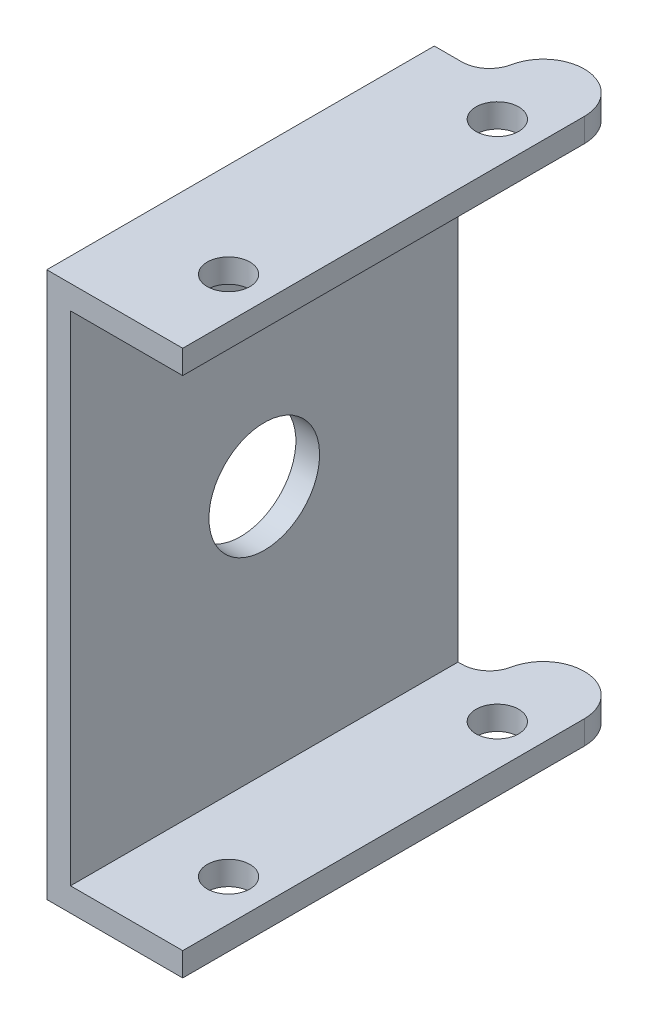
ISO-10303-21;
HEADER;
FILE_DESCRIPTION(('STEP AP214'),'2;1');
FILE_NAME('part.step','',(''),(''),'','','');
FILE_SCHEMA(('AUTOMOTIVE_DESIGN { 1 0 10303 214 1 1 1 1 }'));
ENDSEC;
DATA;
#1=APPLICATION_CONTEXT('core data for automotive mechanical design processes');
#2=APPLICATION_PROTOCOL_DEFINITION('international standard','automotive_design',2000,#1);
#3=PRODUCT_CONTEXT('',#1,'mechanical');
#4=PRODUCT('Part','Part','',(#3));
#5=PRODUCT_RELATED_PRODUCT_CATEGORY('part','',(#4));
#6=PRODUCT_DEFINITION_FORMATION('','',#4);
#7=PRODUCT_DEFINITION_CONTEXT('part definition',#1,'design');
#8=PRODUCT_DEFINITION('design','',#6,#7);
#9=PRODUCT_DEFINITION_SHAPE('','',#8);
#10=(LENGTH_UNIT() NAMED_UNIT(*) SI_UNIT(.MILLI.,.METRE.));
#11=(NAMED_UNIT(*) PLANE_ANGLE_UNIT() SI_UNIT($,.RADIAN.));
#12=(NAMED_UNIT(*) SI_UNIT($,.STERADIAN.) SOLID_ANGLE_UNIT());
#13=UNCERTAINTY_MEASURE_WITH_UNIT(LENGTH_MEASURE(1.E-05),#10,'distance_accuracy_value','');
#14=(GEOMETRIC_REPRESENTATION_CONTEXT(3) GLOBAL_UNCERTAINTY_ASSIGNED_CONTEXT((#13)) GLOBAL_UNIT_ASSIGNED_CONTEXT((#10,
#11,#12)) REPRESENTATION_CONTEXT('',''));
#15=CARTESIAN_POINT('',(0.,0.,0.));
#16=DIRECTION('',(0.,0.,1.));
#17=DIRECTION('',(1.,0.,0.));
#18=AXIS2_PLACEMENT_3D('',#15,#16,#17);
#19=CARTESIAN_POINT('',(8.6,0.,14.));
#20=DIRECTION('',(0.,1.,0.));
#21=DIRECTION('',(-1.,0.,0.));
#22=AXIS2_PLACEMENT_3D('',#19,#20,#21);
#23=PLANE('',#22);
#24=CARTESIAN_POINT('',(6.,0.,8.5));
#25=DIRECTION('',(0.,1.,0.));
#26=DIRECTION('',(-1.,0.,0.));
#27=AXIS2_PLACEMENT_3D('',#24,#25,#26);
#28=CIRCLE('',#27,1.35);
#29=CARTESIAN_POINT('',(4.65,0.,8.5));
#30=VERTEX_POINT('',#29);
#31=EDGE_CURVE('E162',#30,#30,#28,.T.);
#32=ORIENTED_EDGE('',*,*,#31,.T.);
#33=EDGE_LOOP('',(#32));
#34=FACE_BOUND('',#33,.T.);
#35=CARTESIAN_POINT('',(6.,0.,-8.5));
#36=DIRECTION('',(0.,1.,0.));
#37=DIRECTION('',(-1.,0.,0.));
#38=AXIS2_PLACEMENT_3D('',#35,#36,#37);
#39=CIRCLE('',#38,1.35);
#40=CARTESIAN_POINT('',(4.65,0.,-8.5));
#41=VERTEX_POINT('',#40);
#42=EDGE_CURVE('E174',#41,#41,#39,.T.);
#43=ORIENTED_EDGE('',*,*,#42,.T.);
#44=EDGE_LOOP('',(#43));
#45=FACE_BOUND('',#44,.T.);
#46=CARTESIAN_POINT('',(6.,0.,-11.4));
#47=DIRECTION('',(0.,1.,0.));
#48=DIRECTION('',(0.,0.,1.));
#49=AXIS2_PLACEMENT_3D('',#46,#47,#48);
#50=CIRCLE('',#49,2.6);
#51=CARTESIAN_POINT('',(8.6,0.,-11.4));
#52=VERTEX_POINT('',#51);
#53=CARTESIAN_POINT('',(3.4511622832782,0.,-11.9132507124364));
#54=VERTEX_POINT('',#53);
#55=EDGE_CURVE('E121',#52,#54,#50,.T.);
#56=ORIENTED_EDGE('',*,*,#55,.F.);
#57=DIRECTION('',(0.,0.,-1.));
#58=VECTOR('',#57,1.);
#59=CARTESIAN_POINT('',(8.6,0.,14.));
#60=LINE('',#59,#58);
#61=CARTESIAN_POINT('',(8.6,0.,14.));
#62=VERTEX_POINT('',#61);
#63=EDGE_CURVE('E10',#62,#52,#60,.T.);
#64=ORIENTED_EDGE('',*,*,#63,.F.);
#65=DIRECTION('',(1.,0.,0.));
#66=VECTOR('',#65,1.);
#67=CARTESIAN_POINT('',(8.6,0.,14.));
#68=LINE('',#67,#66);
#69=CARTESIAN_POINT('',(0.,0.,14.));
#70=VERTEX_POINT('',#69);
#71=EDGE_CURVE('E185',#70,#62,#68,.T.);
#72=ORIENTED_EDGE('',*,*,#71,.F.);
#73=DIRECTION('',(0.,0.,-1.));
#74=VECTOR('',#73,1.);
#75=CARTESIAN_POINT('',(0.,0.,14.));
#76=LINE('',#75,#74);
#77=CARTESIAN_POINT('',(0.,0.,-10.514544668059));
#78=VERTEX_POINT('',#77);
#79=EDGE_CURVE('E125',#70,#78,#76,.T.);
#80=ORIENTED_EDGE('',*,*,#79,.T.);
#81=DIRECTION('',(-1.,0.,0.));
#82=VECTOR('',#81,1.);
#83=CARTESIAN_POINT('',(0.,0.,-10.514544668059));
#84=LINE('',#83,#82);
#85=CARTESIAN_POINT('',(1.74272766597048,0.,-10.514544668059));
#86=VERTEX_POINT('',#85);
#87=EDGE_CURVE('E30',#86,#78,#84,.T.);
#88=ORIENTED_EDGE('',*,*,#87,.F.);
#89=CARTESIAN_POINT('',(1.74272766597048,0.,-12.2572723340295));
#90=DIRECTION('',(0.,1.,0.));
#91=DIRECTION('',(0.,0.,1.));
#92=AXIS2_PLACEMENT_3D('',#89,#90,#91);
#93=CIRCLE('',#92,1.74272766597049);
#94=EDGE_CURVE('E115',#86,#54,#93,.T.);
#95=ORIENTED_EDGE('',*,*,#94,.T.);
#96=EDGE_LOOP('',(#56,#64,#72,#80,#88,#95));
#97=FACE_BOUND('',#96,.T.);
#98=ADVANCED_FACE('F16',(#34,#45,#97),#23,.F.);
#99=CARTESIAN_POINT('',(1.5,1.5,14.));
#100=DIRECTION('',(0.,-1.,0.));
#101=DIRECTION('',(0.,0.,-1.));
#102=AXIS2_PLACEMENT_3D('',#99,#100,#101);
#103=PLANE('',#102);
#104=CARTESIAN_POINT('',(6.,1.5,8.5));
#105=DIRECTION('',(0.,-1.,0.));
#106=DIRECTION('',(0.,0.,-1.));
#107=AXIS2_PLACEMENT_3D('',#104,#105,#106);
#108=CIRCLE('',#107,1.35);
#109=CARTESIAN_POINT('',(6.,1.5,7.15));
#110=VERTEX_POINT('',#109);
#111=EDGE_CURVE('E170',#110,#110,#108,.T.);
#112=ORIENTED_EDGE('',*,*,#111,.T.);
#113=EDGE_LOOP('',(#112));
#114=FACE_BOUND('',#113,.T.);
#115=CARTESIAN_POINT('',(6.,1.5,-8.5));
#116=DIRECTION('',(0.,-1.,0.));
#117=DIRECTION('',(0.,0.,-1.));
#118=AXIS2_PLACEMENT_3D('',#115,#116,#117);
#119=CIRCLE('',#118,1.35);
#120=CARTESIAN_POINT('',(6.,1.5,-9.85));
#121=VERTEX_POINT('',#120);
#122=EDGE_CURVE('E182',#121,#121,#119,.T.);
#123=ORIENTED_EDGE('',*,*,#122,.T.);
#124=EDGE_LOOP('',(#123));
#125=FACE_BOUND('',#124,.T.);
#126=DIRECTION('',(0.,0.,-1.));
#127=VECTOR('',#126,1.);
#128=CARTESIAN_POINT('',(8.6,1.5,14.));
#129=LINE('',#128,#127);
#130=CARTESIAN_POINT('',(8.6,1.5,14.));
#131=VERTEX_POINT('',#130);
#132=CARTESIAN_POINT('',(8.6,1.5,-11.4));
#133=VERTEX_POINT('',#132);
#134=EDGE_CURVE('E23',#131,#133,#129,.T.);
#135=ORIENTED_EDGE('',*,*,#134,.T.);
#136=CARTESIAN_POINT('',(6.,1.5,-11.4));
#137=DIRECTION('',(0.,-1.,0.));
#138=DIRECTION('',(0.,0.,-1.));
#139=AXIS2_PLACEMENT_3D('',#136,#137,#138);
#140=CIRCLE('',#139,2.6);
#141=CARTESIAN_POINT('',(3.4511622832782,1.5,-11.9132507124364));
#142=VERTEX_POINT('',#141);
#143=EDGE_CURVE('E144',#142,#133,#140,.T.);
#144=ORIENTED_EDGE('',*,*,#143,.F.);
#145=CARTESIAN_POINT('',(1.74272766597048,1.5,-12.2572723340295));
#146=DIRECTION('',(0.,-1.,0.));
#147=DIRECTION('',(0.,0.,-1.));
#148=AXIS2_PLACEMENT_3D('',#145,#146,#147);
#149=CIRCLE('',#148,1.74272766597049);
#150=CARTESIAN_POINT('',(1.74272766597048,1.5,-10.514544668059));
#151=VERTEX_POINT('',#150);
#152=EDGE_CURVE('E159',#142,#151,#149,.T.);
#153=ORIENTED_EDGE('',*,*,#152,.T.);
#154=DIRECTION('',(1.,0.,0.));
#155=VECTOR('',#154,1.);
#156=CARTESIAN_POINT('',(1.5,1.5,-10.514544668059));
#157=LINE('',#156,#155);
#158=CARTESIAN_POINT('',(1.5,1.5,-10.514544668059));
#159=VERTEX_POINT('',#158);
#160=EDGE_CURVE('E107',#159,#151,#157,.T.);
#161=ORIENTED_EDGE('',*,*,#160,.F.);
#162=DIRECTION('',(0.,0.,-1.));
#163=VECTOR('',#162,1.);
#164=CARTESIAN_POINT('',(1.5,1.5,14.));
#165=LINE('',#164,#163);
#166=CARTESIAN_POINT('',(1.5,1.5,14.));
#167=VERTEX_POINT('',#166);
#168=EDGE_CURVE('E213',#167,#159,#165,.T.);
#169=ORIENTED_EDGE('',*,*,#168,.F.);
#170=DIRECTION('',(-1.,0.,0.));
#171=VECTOR('',#170,1.);
#172=CARTESIAN_POINT('',(1.5,1.5,14.));
#173=LINE('',#172,#171);
#174=EDGE_CURVE('E189',#131,#167,#173,.T.);
#175=ORIENTED_EDGE('',*,*,#174,.F.);
#176=EDGE_LOOP('',(#135,#144,#153,#161,#169,#175));
#177=FACE_BOUND('',#176,.T.);
#178=ADVANCED_FACE('F220',(#114,#125,#177),#103,.F.);
#179=CARTESIAN_POINT('',(1.5,33.,14.));
#180=DIRECTION('',(-1.,0.,0.));
#181=DIRECTION('',(0.,-1.,0.));
#182=AXIS2_PLACEMENT_3D('',#179,#180,#181);
#183=PLANE('',#182);
#184=CARTESIAN_POINT('',(1.5,17.25,1.74272766597048));
#185=DIRECTION('',(-1.,0.,0.));
#186=DIRECTION('',(0.,-1.,0.));
#187=AXIS2_PLACEMENT_3D('',#184,#185,#186);
#188=CIRCLE('',#187,3.5);
#189=CARTESIAN_POINT('',(1.5,13.75,1.74272766597048));
#190=VERTEX_POINT('',#189);
#191=EDGE_CURVE('E131',#190,#190,#188,.T.);
#192=ORIENTED_EDGE('',*,*,#191,.T.);
#193=EDGE_LOOP('',(#192));
#194=FACE_BOUND('',#193,.T.);
#195=DIRECTION('',(0.,-1.,0.));
#196=VECTOR('',#195,1.);
#197=CARTESIAN_POINT('',(1.5,33.,-10.514544668059));
#198=LINE('',#197,#196);
#199=CARTESIAN_POINT('',(1.5,33.,-10.514544668059));
#200=VERTEX_POINT('',#199);
#201=EDGE_CURVE('E153',#200,#159,#198,.T.);
#202=ORIENTED_EDGE('',*,*,#201,.F.);
#203=DIRECTION('',(0.,0.,-1.));
#204=VECTOR('',#203,1.);
#205=CARTESIAN_POINT('',(1.5,33.,14.));
#206=LINE('',#205,#204);
#207=CARTESIAN_POINT('',(1.5,33.,14.));
#208=VERTEX_POINT('',#207);
#209=EDGE_CURVE('E210',#208,#200,#206,.T.);
#210=ORIENTED_EDGE('',*,*,#209,.F.);
#211=DIRECTION('',(0.,1.,0.));
#212=VECTOR('',#211,1.);
#213=CARTESIAN_POINT('',(1.5,33.,14.));
#214=LINE('',#213,#212);
#215=EDGE_CURVE('E191',#167,#208,#214,.T.);
#216=ORIENTED_EDGE('',*,*,#215,.F.);
#217=ORIENTED_EDGE('',*,*,#168,.T.);
#218=EDGE_LOOP('',(#202,#210,#216,#217));
#219=FACE_BOUND('',#218,.T.);
#220=ADVANCED_FACE('F232',(#194,#219),#183,.F.);
#221=CARTESIAN_POINT('',(8.6,33.,14.));
#222=DIRECTION('',(0.,1.,0.));
#223=DIRECTION('',(0.,0.,1.));
#224=AXIS2_PLACEMENT_3D('',#221,#222,#223);
#225=PLANE('',#224);
#226=CARTESIAN_POINT('',(6.,33.,8.5));
#227=DIRECTION('',(0.,1.,0.));
#228=DIRECTION('',(0.,0.,1.));
#229=AXIS2_PLACEMENT_3D('',#226,#227,#228);
#230=CIRCLE('',#229,1.35);
#231=CARTESIAN_POINT('',(6.,33.,9.85));
#232=VERTEX_POINT('',#231);
#233=EDGE_CURVE('E165',#232,#232,#230,.T.);
#234=ORIENTED_EDGE('',*,*,#233,.T.);
#235=EDGE_LOOP('',(#234));
#236=FACE_BOUND('',#235,.T.);
#237=CARTESIAN_POINT('',(6.,33.,-8.5));
#238=DIRECTION('',(0.,1.,0.));
#239=DIRECTION('',(0.,0.,1.));
#240=AXIS2_PLACEMENT_3D('',#237,#238,#239);
#241=CIRCLE('',#240,1.35);
#242=CARTESIAN_POINT('',(6.,33.,-7.15));
#243=VERTEX_POINT('',#242);
#244=EDGE_CURVE('E177',#243,#243,#241,.T.);
#245=ORIENTED_EDGE('',*,*,#244,.T.);
#246=EDGE_LOOP('',(#245));
#247=FACE_BOUND('',#246,.T.);
#248=CARTESIAN_POINT('',(6.,33.,-11.4));
#249=DIRECTION('',(0.,1.,0.));
#250=DIRECTION('',(0.,0.,1.));
#251=AXIS2_PLACEMENT_3D('',#248,#249,#250);
#252=CIRCLE('',#251,2.6);
#253=CARTESIAN_POINT('',(8.6,33.,-11.4));
#254=VERTEX_POINT('',#253);
#255=CARTESIAN_POINT('',(3.4511622832782,33.,-11.9132507124364));
#256=VERTEX_POINT('',#255);
#257=EDGE_CURVE('E148',#254,#256,#252,.T.);
#258=ORIENTED_EDGE('',*,*,#257,.F.);
#259=DIRECTION('',(0.,0.,-1.));
#260=VECTOR('',#259,1.);
#261=CARTESIAN_POINT('',(8.6,33.,14.));
#262=LINE('',#261,#260);
#263=CARTESIAN_POINT('',(8.6,33.,14.));
#264=VERTEX_POINT('',#263);
#265=EDGE_CURVE('E207',#264,#254,#262,.T.);
#266=ORIENTED_EDGE('',*,*,#265,.F.);
#267=DIRECTION('',(1.,0.,0.));
#268=VECTOR('',#267,1.);
#269=CARTESIAN_POINT('',(8.6,33.,14.));
#270=LINE('',#269,#268);
#271=EDGE_CURVE('E193',#208,#264,#270,.T.);
#272=ORIENTED_EDGE('',*,*,#271,.F.);
#273=ORIENTED_EDGE('',*,*,#209,.T.);
#274=DIRECTION('',(-1.,0.,0.));
#275=VECTOR('',#274,1.);
#276=CARTESIAN_POINT('',(8.6,33.,-10.514544668059));
#277=LINE('',#276,#275);
#278=CARTESIAN_POINT('',(1.74272766597048,33.,-10.514544668059));
#279=VERTEX_POINT('',#278);
#280=EDGE_CURVE('E150',#279,#200,#277,.T.);
#281=ORIENTED_EDGE('',*,*,#280,.F.);
#282=CARTESIAN_POINT('',(1.74272766597048,33.,-12.2572723340295));
#283=DIRECTION('',(0.,1.,0.));
#284=DIRECTION('',(0.,0.,1.));
#285=AXIS2_PLACEMENT_3D('',#282,#283,#284);
#286=CIRCLE('',#285,1.74272766597049);
#287=EDGE_CURVE('E156',#279,#256,#286,.T.);
#288=ORIENTED_EDGE('',*,*,#287,.T.);
#289=EDGE_LOOP('',(#258,#266,#272,#273,#281,#288));
#290=FACE_BOUND('',#289,.T.);
#291=ADVANCED_FACE('F238',(#236,#247,#290),#225,.F.);
#292=CARTESIAN_POINT('',(0.,34.5,14.));
#293=DIRECTION('',(0.,-1.,0.));
#294=DIRECTION('',(0.,0.,-1.));
#295=AXIS2_PLACEMENT_3D('',#292,#293,#294);
#296=PLANE('',#295);
#297=CARTESIAN_POINT('',(6.,34.5,8.5));
#298=DIRECTION('',(0.,1.,0.));
#299=DIRECTION('',(-1.,0.,0.));
#300=AXIS2_PLACEMENT_3D('',#297,#298,#299);
#301=CIRCLE('',#300,1.35);
#302=CARTESIAN_POINT('',(4.65,34.5,8.5));
#303=VERTEX_POINT('',#302);
#304=EDGE_CURVE('E161',#303,#303,#301,.T.);
#305=ORIENTED_EDGE('',*,*,#304,.F.);
#306=EDGE_LOOP('',(#305));
#307=FACE_BOUND('',#306,.T.);
#308=CARTESIAN_POINT('',(6.,34.5,-8.5));
#309=DIRECTION('',(0.,1.,0.));
#310=DIRECTION('',(-1.,0.,0.));
#311=AXIS2_PLACEMENT_3D('',#308,#309,#310);
#312=CIRCLE('',#311,1.35);
#313=CARTESIAN_POINT('',(4.65,34.5,-8.5));
#314=VERTEX_POINT('',#313);
#315=EDGE_CURVE('E173',#314,#314,#312,.T.);
#316=ORIENTED_EDGE('',*,*,#315,.F.);
#317=EDGE_LOOP('',(#316));
#318=FACE_BOUND('',#317,.T.);
#319=CARTESIAN_POINT('',(6.,34.5,-11.4));
#320=DIRECTION('',(0.,1.,0.));
#321=DIRECTION('',(0.,0.,1.));
#322=AXIS2_PLACEMENT_3D('',#319,#320,#321);
#323=CIRCLE('',#322,2.6);
#324=CARTESIAN_POINT('',(8.6,34.5,-11.4));
#325=VERTEX_POINT('',#324);
#326=CARTESIAN_POINT('',(3.4511622832782,34.5,-11.9132507124364));
#327=VERTEX_POINT('',#326);
#328=EDGE_CURVE('E126',#325,#327,#323,.T.);
#329=ORIENTED_EDGE('',*,*,#328,.T.);
#330=CARTESIAN_POINT('',(1.74272766597048,34.5,-12.2572723340295));
#331=DIRECTION('',(0.,1.,0.));
#332=DIRECTION('',(0.,0.,1.));
#333=AXIS2_PLACEMENT_3D('',#330,#331,#332);
#334=CIRCLE('',#333,1.74272766597049);
#335=CARTESIAN_POINT('',(1.74272766597048,34.5,-10.514544668059));
#336=VERTEX_POINT('',#335);
#337=EDGE_CURVE('E128',#336,#327,#334,.T.);
#338=ORIENTED_EDGE('',*,*,#337,.F.);
#339=DIRECTION('',(-1.,0.,0.));
#340=VECTOR('',#339,1.);
#341=CARTESIAN_POINT('',(0.,34.5,-10.514544668059));
#342=LINE('',#341,#340);
#343=CARTESIAN_POINT('',(0.,34.5,-10.514544668059));
#344=VERTEX_POINT('',#343);
#345=EDGE_CURVE('E136',#336,#344,#342,.T.);
#346=ORIENTED_EDGE('',*,*,#345,.T.);
#347=DIRECTION('',(0.,0.,-1.));
#348=VECTOR('',#347,1.);
#349=CARTESIAN_POINT('',(0.,34.5,14.));
#350=LINE('',#349,#348);
#351=CARTESIAN_POINT('',(0.,34.5,14.));
#352=VERTEX_POINT('',#351);
#353=EDGE_CURVE('E201',#352,#344,#350,.T.);
#354=ORIENTED_EDGE('',*,*,#353,.F.);
#355=DIRECTION('',(-1.,0.,0.));
#356=VECTOR('',#355,1.);
#357=CARTESIAN_POINT('',(0.,34.5,14.));
#358=LINE('',#357,#356);
#359=CARTESIAN_POINT('',(8.6,34.5,14.));
#360=VERTEX_POINT('',#359);
#361=EDGE_CURVE('E197',#360,#352,#358,.T.);
#362=ORIENTED_EDGE('',*,*,#361,.F.);
#363=DIRECTION('',(0.,0.,-1.));
#364=VECTOR('',#363,1.);
#365=CARTESIAN_POINT('',(8.6,34.5,14.));
#366=LINE('',#365,#364);
#367=EDGE_CURVE('E204',#360,#325,#366,.T.);
#368=ORIENTED_EDGE('',*,*,#367,.T.);
#369=EDGE_LOOP('',(#329,#338,#346,#354,#362,#368));
#370=FACE_BOUND('',#369,.T.);
#371=ADVANCED_FACE('F247',(#307,#318,#370),#296,.F.);
#372=CARTESIAN_POINT('',(0.,0.,14.));
#373=DIRECTION('',(1.,0.,0.));
#374=DIRECTION('',(0.,0.,-1.));
#375=AXIS2_PLACEMENT_3D('',#372,#373,#374);
#376=PLANE('',#375);
#377=CARTESIAN_POINT('',(0.,17.25,1.74272766597048));
#378=DIRECTION('',(-1.,0.,0.));
#379=DIRECTION('',(0.,0.,1.));
#380=AXIS2_PLACEMENT_3D('',#377,#378,#379);
#381=CIRCLE('',#380,3.5);
#382=CARTESIAN_POINT('',(0.,17.25,5.24272766597048));
#383=VERTEX_POINT('',#382);
#384=EDGE_CURVE('E440',#383,#383,#381,.T.);
#385=ORIENTED_EDGE('',*,*,#384,.F.);
#386=EDGE_LOOP('',(#385));
#387=FACE_BOUND('',#386,.T.);
#388=DIRECTION('',(0.,1.,0.));
#389=VECTOR('',#388,1.);
#390=CARTESIAN_POINT('',(0.,0.,-10.514544668059));
#391=LINE('',#390,#389);
#392=EDGE_CURVE('E135',#78,#344,#391,.T.);
#393=ORIENTED_EDGE('',*,*,#392,.F.);
#394=ORIENTED_EDGE('',*,*,#79,.F.);
#395=DIRECTION('',(0.,-1.,0.));
#396=VECTOR('',#395,1.);
#397=CARTESIAN_POINT('',(0.,0.,14.));
#398=LINE('',#397,#396);
#399=EDGE_CURVE('E38',#352,#70,#398,.T.);
#400=ORIENTED_EDGE('',*,*,#399,.F.);
#401=ORIENTED_EDGE('',*,*,#353,.T.);
#402=EDGE_LOOP('',(#393,#394,#400,#401));
#403=FACE_BOUND('',#402,.T.);
#404=ADVANCED_FACE('F251',(#387,#403),#376,.F.);
#405=CARTESIAN_POINT('',(8.6,1.5,14.));
#406=DIRECTION('',(-1.,0.,0.));
#407=DIRECTION('',(0.,0.,1.));
#408=AXIS2_PLACEMENT_3D('',#405,#406,#407);
#409=PLANE('',#408);
#410=ORIENTED_EDGE('',*,*,#63,.T.);
#411=DIRECTION('',(0.,1.,0.));
#412=VECTOR('',#411,1.);
#413=CARTESIAN_POINT('',(8.6,0.,-11.4));
#414=LINE('',#413,#412);
#415=EDGE_CURVE('E141',#52,#133,#414,.T.);
#416=ORIENTED_EDGE('',*,*,#415,.T.);
#417=ORIENTED_EDGE('',*,*,#134,.F.);
#418=DIRECTION('',(0.,1.,0.));
#419=VECTOR('',#418,1.);
#420=CARTESIAN_POINT('',(8.6,1.5,14.));
#421=LINE('',#420,#419);
#422=EDGE_CURVE('E187',#62,#131,#421,.T.);
#423=ORIENTED_EDGE('',*,*,#422,.F.);
#424=EDGE_LOOP('',(#410,#416,#417,#423));
#425=FACE_BOUND('',#424,.T.);
#426=ADVANCED_FACE('F223',(#425),#409,.F.);
#427=CARTESIAN_POINT('',(8.6,34.5,14.));
#428=DIRECTION('',(-1.,0.,0.));
#429=DIRECTION('',(0.,-1.,0.));
#430=AXIS2_PLACEMENT_3D('',#427,#428,#429);
#431=PLANE('',#430);
#432=ORIENTED_EDGE('',*,*,#265,.T.);
#433=EDGE_CURVE('E145',#254,#325,#414,.T.);
#434=ORIENTED_EDGE('',*,*,#433,.T.);
#435=ORIENTED_EDGE('',*,*,#367,.F.);
#436=DIRECTION('',(0.,1.,0.));
#437=VECTOR('',#436,1.);
#438=CARTESIAN_POINT('',(8.6,34.5,14.));
#439=LINE('',#438,#437);
#440=EDGE_CURVE('E195',#264,#360,#439,.T.);
#441=ORIENTED_EDGE('',*,*,#440,.F.);
#442=EDGE_LOOP('',(#432,#434,#435,#441));
#443=FACE_BOUND('',#442,.T.);
#444=ADVANCED_FACE('F245',(#443),#431,.F.);
#445=CARTESIAN_POINT('',(0.,0.,14.));
#446=DIRECTION('',(0.,0.,-1.));
#447=DIRECTION('',(-1.,0.,0.));
#448=AXIS2_PLACEMENT_3D('',#445,#446,#447);
#449=PLANE('',#448);
#450=ORIENTED_EDGE('',*,*,#71,.T.);
#451=ORIENTED_EDGE('',*,*,#422,.T.);
#452=ORIENTED_EDGE('',*,*,#174,.T.);
#453=ORIENTED_EDGE('',*,*,#215,.T.);
#454=ORIENTED_EDGE('',*,*,#271,.T.);
#455=ORIENTED_EDGE('',*,*,#440,.T.);
#456=ORIENTED_EDGE('',*,*,#361,.T.);
#457=ORIENTED_EDGE('',*,*,#399,.T.);
#458=EDGE_LOOP('',(#450,#451,#452,#453,#454,#455,#456,#457));
#459=FACE_BOUND('',#458,.T.);
#460=ADVANCED_FACE('F227',(#459),#449,.F.);
#461=CARTESIAN_POINT('',(6.,0.,-8.5));
#462=DIRECTION('',(0.,1.,0.));
#463=DIRECTION('',(-1.,0.,0.));
#464=AXIS2_PLACEMENT_3D('',#461,#462,#463);
#465=CYLINDRICAL_SURFACE('',#464,1.35);
#466=ORIENTED_EDGE('',*,*,#315,.T.);
#467=EDGE_LOOP('',(#466));
#468=FACE_BOUND('',#467,.T.);
#469=ORIENTED_EDGE('',*,*,#244,.F.);
#470=EDGE_LOOP('',(#469));
#471=FACE_BOUND('',#470,.T.);
#472=ADVANCED_FACE('F287',(#468,#471),#465,.F.);
#473=ORIENTED_EDGE('',*,*,#42,.F.);
#474=EDGE_LOOP('',(#473));
#475=FACE_BOUND('',#474,.T.);
#476=ORIENTED_EDGE('',*,*,#122,.F.);
#477=EDGE_LOOP('',(#476));
#478=FACE_BOUND('',#477,.T.);
#479=ADVANCED_FACE('F283',(#475,#478),#465,.F.);
#480=CARTESIAN_POINT('',(6.,0.,8.5));
#481=DIRECTION('',(0.,1.,0.));
#482=DIRECTION('',(-1.,0.,0.));
#483=AXIS2_PLACEMENT_3D('',#480,#481,#482);
#484=CYLINDRICAL_SURFACE('',#483,1.35);
#485=ORIENTED_EDGE('',*,*,#304,.T.);
#486=EDGE_LOOP('',(#485));
#487=FACE_BOUND('',#486,.T.);
#488=ORIENTED_EDGE('',*,*,#233,.F.);
#489=EDGE_LOOP('',(#488));
#490=FACE_BOUND('',#489,.T.);
#491=ADVANCED_FACE('F286',(#487,#490),#484,.F.);
#492=ORIENTED_EDGE('',*,*,#31,.F.);
#493=EDGE_LOOP('',(#492));
#494=FACE_BOUND('',#493,.T.);
#495=ORIENTED_EDGE('',*,*,#111,.F.);
#496=EDGE_LOOP('',(#495));
#497=FACE_BOUND('',#496,.T.);
#498=ADVANCED_FACE('F296',(#494,#497),#484,.F.);
#499=CARTESIAN_POINT('',(1.74272766597048,0.,-12.2572723340295));
#500=DIRECTION('',(0.,1.,0.));
#501=DIRECTION('',(0.,0.,1.));
#502=AXIS2_PLACEMENT_3D('',#499,#500,#501);
#503=CYLINDRICAL_SURFACE('',#502,1.74272766597049);
#504=DIRECTION('',(0.,1.,0.));
#505=VECTOR('',#504,1.);
#506=CARTESIAN_POINT('',(3.4511622832782,0.,-11.9132507124364));
#507=LINE('',#506,#505);
#508=EDGE_CURVE('E118',#54,#142,#507,.T.);
#509=ORIENTED_EDGE('',*,*,#508,.F.);
#510=ORIENTED_EDGE('',*,*,#94,.F.);
#511=DIRECTION('',(0.,1.,0.));
#512=VECTOR('',#511,1.);
#513=CARTESIAN_POINT('',(1.74272766597048,0.,-10.514544668059));
#514=LINE('',#513,#512);
#515=EDGE_CURVE('E103',#86,#151,#514,.T.);
#516=ORIENTED_EDGE('',*,*,#515,.T.);
#517=ORIENTED_EDGE('',*,*,#152,.F.);
#518=EDGE_LOOP('',(#509,#510,#516,#517));
#519=FACE_BOUND('',#518,.T.);
#520=ADVANCED_FACE('F116',(#519),#503,.F.);
#521=EDGE_CURVE('E111',#279,#336,#514,.T.);
#522=ORIENTED_EDGE('',*,*,#521,.T.);
#523=ORIENTED_EDGE('',*,*,#337,.T.);
#524=EDGE_CURVE('E110',#256,#327,#507,.T.);
#525=ORIENTED_EDGE('',*,*,#524,.F.);
#526=ORIENTED_EDGE('',*,*,#287,.F.);
#527=EDGE_LOOP('',(#522,#523,#525,#526));
#528=FACE_BOUND('',#527,.T.);
#529=ADVANCED_FACE('F256',(#528),#503,.F.);
#530=CARTESIAN_POINT('',(0.,0.,-10.514544668059));
#531=DIRECTION('',(0.,0.,-1.));
#532=DIRECTION('',(-1.,0.,0.));
#533=AXIS2_PLACEMENT_3D('',#530,#531,#532);
#534=PLANE('',#533);
#535=ORIENTED_EDGE('',*,*,#160,.T.);
#536=ORIENTED_EDGE('',*,*,#515,.F.);
#537=ORIENTED_EDGE('',*,*,#87,.T.);
#538=ORIENTED_EDGE('',*,*,#392,.T.);
#539=ORIENTED_EDGE('',*,*,#345,.F.);
#540=ORIENTED_EDGE('',*,*,#521,.F.);
#541=ORIENTED_EDGE('',*,*,#280,.T.);
#542=ORIENTED_EDGE('',*,*,#201,.T.);
#543=EDGE_LOOP('',(#535,#536,#537,#538,#539,#540,#541,#542));
#544=FACE_BOUND('',#543,.T.);
#545=ADVANCED_FACE('F105',(#544),#534,.T.);
#546=CARTESIAN_POINT('',(6.,0.,-11.4));
#547=DIRECTION('',(0.,1.,0.));
#548=DIRECTION('',(0.,0.,1.));
#549=AXIS2_PLACEMENT_3D('',#546,#547,#548);
#550=CYLINDRICAL_SURFACE('',#549,2.6);
#551=ORIENTED_EDGE('',*,*,#143,.T.);
#552=ORIENTED_EDGE('',*,*,#415,.F.);
#553=ORIENTED_EDGE('',*,*,#55,.T.);
#554=ORIENTED_EDGE('',*,*,#508,.T.);
#555=EDGE_LOOP('',(#551,#552,#553,#554));
#556=FACE_BOUND('',#555,.T.);
#557=ADVANCED_FACE('F226',(#556),#550,.T.);
#558=ORIENTED_EDGE('',*,*,#257,.T.);
#559=ORIENTED_EDGE('',*,*,#524,.T.);
#560=ORIENTED_EDGE('',*,*,#328,.F.);
#561=ORIENTED_EDGE('',*,*,#433,.F.);
#562=EDGE_LOOP('',(#558,#559,#560,#561));
#563=FACE_BOUND('',#562,.T.);
#564=ADVANCED_FACE('F258',(#563),#550,.T.);
#565=CARTESIAN_POINT('',(8.6,17.25,1.74272766597048));
#566=DIRECTION('',(-1.,0.,0.));
#567=DIRECTION('',(0.,0.,1.));
#568=AXIS2_PLACEMENT_3D('',#565,#566,#567);
#569=CYLINDRICAL_SURFACE('',#568,3.5);
#570=ORIENTED_EDGE('',*,*,#384,.T.);
#571=EDGE_LOOP('',(#570));
#572=FACE_BOUND('',#571,.T.);
#573=ORIENTED_EDGE('',*,*,#191,.F.);
#574=EDGE_LOOP('',(#573));
#575=FACE_BOUND('',#574,.T.);
#576=ADVANCED_FACE('F260',(#572,#575),#569,.F.);
#577=CLOSED_SHELL('',(#98,#178,#220,#291,#371,#404,#426,#444,#460,#472,#479,#491,#498,#520,#529,
#545,#557,#564,#576));
#578=MANIFOLD_SOLID_BREP('B1',#577);
#579=ADVANCED_BREP_SHAPE_REPRESENTATION('',(#18,#578),#14);
#580=SHAPE_DEFINITION_REPRESENTATION(#9,#579);
ENDSEC;
END-ISO-10303-21;
